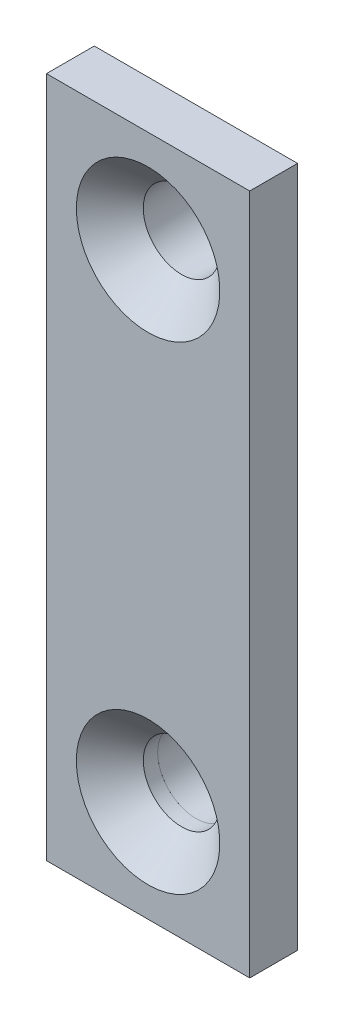
ISO-10303-21;
HEADER;
FILE_DESCRIPTION(('STEP AP214'),'2;1');
FILE_NAME('part.step','',(''),(''),'','','');
FILE_SCHEMA(('AUTOMOTIVE_DESIGN { 1 0 10303 214 1 1 1 1 }'));
ENDSEC;
DATA;
#1=APPLICATION_CONTEXT('core data for automotive mechanical design processes');
#2=APPLICATION_PROTOCOL_DEFINITION('international standard','automotive_design',2000,#1);
#3=PRODUCT_CONTEXT('',#1,'mechanical');
#4=PRODUCT('Part','Part','',(#3));
#5=PRODUCT_RELATED_PRODUCT_CATEGORY('part','',(#4));
#6=PRODUCT_DEFINITION_FORMATION('','',#4);
#7=PRODUCT_DEFINITION_CONTEXT('part definition',#1,'design');
#8=PRODUCT_DEFINITION('design','',#6,#7);
#9=PRODUCT_DEFINITION_SHAPE('','',#8);
#10=(LENGTH_UNIT() NAMED_UNIT(*) SI_UNIT(.MILLI.,.METRE.));
#11=(NAMED_UNIT(*) PLANE_ANGLE_UNIT() SI_UNIT($,.RADIAN.));
#12=(NAMED_UNIT(*) SI_UNIT($,.STERADIAN.) SOLID_ANGLE_UNIT());
#13=UNCERTAINTY_MEASURE_WITH_UNIT(LENGTH_MEASURE(1.E-05),#10,'distance_accuracy_value','');
#14=(GEOMETRIC_REPRESENTATION_CONTEXT(3) GLOBAL_UNCERTAINTY_ASSIGNED_CONTEXT((#13)) GLOBAL_UNIT_ASSIGNED_CONTEXT((#10,
#11,#12)) REPRESENTATION_CONTEXT('',''));
#15=CARTESIAN_POINT('',(0.,0.,0.));
#16=DIRECTION('',(0.,0.,1.));
#17=DIRECTION('',(1.,0.,0.));
#18=AXIS2_PLACEMENT_3D('',#15,#16,#17);
#19=CARTESIAN_POINT('',(0.,-7.5,2.));
#20=DIRECTION('',(0.,1.,0.));
#21=DIRECTION('',(0.,0.,1.));
#22=AXIS2_PLACEMENT_3D('',#19,#20,#21);
#23=PLANE('',#22);
#24=DIRECTION('',(1.,0.,0.));
#25=VECTOR('',#24,1.);
#26=CARTESIAN_POINT('',(0.,-7.5,0.));
#27=LINE('',#26,#25);
#28=CARTESIAN_POINT('',(-2.25,-7.5,0.));
#29=VERTEX_POINT('',#28);
#30=CARTESIAN_POINT('',(2.25,-7.5,0.));
#31=VERTEX_POINT('',#30);
#32=EDGE_CURVE('E171',#29,#31,#27,.T.);
#33=ORIENTED_EDGE('',*,*,#32,.F.);
#34=DIRECTION('',(0.,0.,-1.));
#35=VECTOR('',#34,1.);
#36=CARTESIAN_POINT('',(-2.25,-7.5,2.));
#37=LINE('',#36,#35);
#38=CARTESIAN_POINT('',(-2.25,-7.5,2.));
#39=VERTEX_POINT('',#38);
#40=EDGE_CURVE('E13',#39,#29,#37,.T.);
#41=ORIENTED_EDGE('',*,*,#40,.F.);
#42=DIRECTION('',(1.,0.,0.));
#43=VECTOR('',#42,1.);
#44=CARTESIAN_POINT('',(0.,-7.5,2.));
#45=LINE('',#44,#43);
#46=CARTESIAN_POINT('',(2.25,-7.5,2.));
#47=VERTEX_POINT('',#46);
#48=EDGE_CURVE('E155',#39,#47,#45,.T.);
#49=ORIENTED_EDGE('',*,*,#48,.T.);
#50=DIRECTION('',(0.,0.,-1.));
#51=VECTOR('',#50,1.);
#52=CARTESIAN_POINT('',(2.25,-7.5,2.));
#53=LINE('',#52,#51);
#54=EDGE_CURVE('E132',#47,#31,#53,.T.);
#55=ORIENTED_EDGE('',*,*,#54,.T.);
#56=EDGE_LOOP('',(#33,#41,#49,#55));
#57=FACE_BOUND('',#56,.T.);
#58=ADVANCED_FACE('F91',(#57),#23,.T.);
#59=CARTESIAN_POINT('',(-2.25,0.,2.));
#60=DIRECTION('',(-1.,0.,0.));
#61=DIRECTION('',(0.,0.,1.));
#62=AXIS2_PLACEMENT_3D('',#59,#60,#61);
#63=PLANE('',#62);
#64=DIRECTION('',(0.,1.,0.));
#65=VECTOR('',#64,1.);
#66=CARTESIAN_POINT('',(-2.25,0.,0.));
#67=LINE('',#66,#65);
#68=CARTESIAN_POINT('',(-2.25,-12.25,0.));
#69=VERTEX_POINT('',#68);
#70=EDGE_CURVE('E144',#69,#29,#67,.T.);
#71=ORIENTED_EDGE('',*,*,#70,.F.);
#72=DIRECTION('',(0.,0.,-1.));
#73=VECTOR('',#72,1.);
#74=CARTESIAN_POINT('',(-2.25,-12.25,2.));
#75=LINE('',#74,#73);
#76=CARTESIAN_POINT('',(-2.25,-12.25,2.));
#77=VERTEX_POINT('',#76);
#78=EDGE_CURVE('E101',#77,#69,#75,.T.);
#79=ORIENTED_EDGE('',*,*,#78,.F.);
#80=DIRECTION('',(0.,1.,0.));
#81=VECTOR('',#80,1.);
#82=CARTESIAN_POINT('',(-2.25,0.,2.));
#83=LINE('',#82,#81);
#84=EDGE_CURVE('E142',#77,#39,#83,.T.);
#85=ORIENTED_EDGE('',*,*,#84,.T.);
#86=ORIENTED_EDGE('',*,*,#40,.T.);
#87=EDGE_LOOP('',(#71,#79,#85,#86));
#88=FACE_BOUND('',#87,.T.);
#89=ADVANCED_FACE('F140',(#88),#63,.T.);
#90=CARTESIAN_POINT('',(0.,-12.25,2.));
#91=DIRECTION('',(0.,1.,0.));
#92=DIRECTION('',(0.,0.,1.));
#93=AXIS2_PLACEMENT_3D('',#90,#91,#92);
#94=PLANE('',#93);
#95=DIRECTION('',(1.,0.,0.));
#96=VECTOR('',#95,1.);
#97=CARTESIAN_POINT('',(0.,-12.25,0.));
#98=LINE('',#97,#96);
#99=CARTESIAN_POINT('',(2.25,-12.25,0.));
#100=VERTEX_POINT('',#99);
#101=EDGE_CURVE('E175',#69,#100,#98,.T.);
#102=ORIENTED_EDGE('',*,*,#101,.T.);
#103=DIRECTION('',(0.,0.,-1.));
#104=VECTOR('',#103,1.);
#105=CARTESIAN_POINT('',(2.25,-12.25,2.));
#106=LINE('',#105,#104);
#107=CARTESIAN_POINT('',(2.25,-12.25,2.));
#108=VERTEX_POINT('',#107);
#109=EDGE_CURVE('E148',#108,#100,#106,.T.);
#110=ORIENTED_EDGE('',*,*,#109,.F.);
#111=DIRECTION('',(1.,0.,0.));
#112=VECTOR('',#111,1.);
#113=CARTESIAN_POINT('',(0.,-12.25,2.));
#114=LINE('',#113,#112);
#115=EDGE_CURVE('E150',#77,#108,#114,.T.);
#116=ORIENTED_EDGE('',*,*,#115,.F.);
#117=ORIENTED_EDGE('',*,*,#78,.T.);
#118=EDGE_LOOP('',(#102,#110,#116,#117));
#119=FACE_BOUND('',#118,.T.);
#120=ADVANCED_FACE('F151',(#119),#94,.F.);
#121=CARTESIAN_POINT('',(0.,-10.,2.));
#122=DIRECTION('',(0.,0.,-1.));
#123=DIRECTION('',(-1.,0.,0.));
#124=AXIS2_PLACEMENT_3D('',#121,#122,#123);
#125=CYLINDRICAL_SURFACE('',#124,1.6);
#126=CARTESIAN_POINT('',(0.,-10.,2.));
#127=DIRECTION('',(0.,0.,1.));
#128=DIRECTION('',(1.,0.,0.));
#129=AXIS2_PLACEMENT_3D('',#126,#127,#128);
#130=CIRCLE('',#129,1.6);
#131=CARTESIAN_POINT('',(1.6,-10.,2.));
#132=VERTEX_POINT('',#131);
#133=EDGE_CURVE('E161',#132,#132,#130,.T.);
#134=ORIENTED_EDGE('',*,*,#133,.T.);
#135=EDGE_LOOP('',(#134));
#136=FACE_BOUND('',#135,.T.);
#137=CARTESIAN_POINT('',(0.,-10.,0.));
#138=DIRECTION('',(0.,0.,1.));
#139=DIRECTION('',(1.,0.,0.));
#140=AXIS2_PLACEMENT_3D('',#137,#138,#139);
#141=CIRCLE('',#140,1.6);
#142=CARTESIAN_POINT('',(1.6,-10.,0.));
#143=VERTEX_POINT('',#142);
#144=EDGE_CURVE('E167',#143,#143,#141,.T.);
#145=ORIENTED_EDGE('',*,*,#144,.F.);
#146=EDGE_LOOP('',(#145));
#147=FACE_BOUND('',#146,.T.);
#148=ADVANCED_FACE('F93',(#136,#147),#125,.F.);
#149=CARTESIAN_POINT('',(2.25,0.,2.));
#150=DIRECTION('',(-1.,0.,0.));
#151=DIRECTION('',(0.,0.,1.));
#152=AXIS2_PLACEMENT_3D('',#149,#150,#151);
#153=PLANE('',#152);
#154=DIRECTION('',(0.,1.,0.));
#155=VECTOR('',#154,1.);
#156=CARTESIAN_POINT('',(2.25,0.,0.));
#157=LINE('',#156,#155);
#158=EDGE_CURVE('E125',#100,#31,#157,.T.);
#159=ORIENTED_EDGE('',*,*,#158,.T.);
#160=ORIENTED_EDGE('',*,*,#54,.F.);
#161=DIRECTION('',(0.,1.,0.));
#162=VECTOR('',#161,1.);
#163=CARTESIAN_POINT('',(2.25,0.,2.));
#164=LINE('',#163,#162);
#165=EDGE_CURVE('E109',#108,#47,#164,.T.);
#166=ORIENTED_EDGE('',*,*,#165,.F.);
#167=ORIENTED_EDGE('',*,*,#109,.T.);
#168=EDGE_LOOP('',(#159,#160,#166,#167));
#169=FACE_BOUND('',#168,.T.);
#170=ADVANCED_FACE('F183',(#169),#153,.F.);
#171=CARTESIAN_POINT('',(0.,0.,2.));
#172=DIRECTION('',(0.,0.,1.));
#173=DIRECTION('',(1.,0.,0.));
#174=AXIS2_PLACEMENT_3D('',#171,#172,#173);
#175=PLANE('',#174);
#176=ORIENTED_EDGE('',*,*,#133,.F.);
#177=EDGE_LOOP('',(#176));
#178=FACE_BOUND('',#177,.T.);
#179=ORIENTED_EDGE('',*,*,#48,.F.);
#180=ORIENTED_EDGE('',*,*,#84,.F.);
#181=ORIENTED_EDGE('',*,*,#115,.T.);
#182=ORIENTED_EDGE('',*,*,#165,.T.);
#183=EDGE_LOOP('',(#179,#180,#181,#182));
#184=FACE_BOUND('',#183,.T.);
#185=ADVANCED_FACE('F154',(#178,#184),#175,.T.);
#186=CARTESIAN_POINT('',(0.,0.,0.));
#187=DIRECTION('',(0.,0.,1.));
#188=DIRECTION('',(1.,0.,0.));
#189=AXIS2_PLACEMENT_3D('',#186,#187,#188);
#190=PLANE('',#189);
#191=ORIENTED_EDGE('',*,*,#144,.T.);
#192=EDGE_LOOP('',(#191));
#193=FACE_BOUND('',#192,.T.);
#194=ORIENTED_EDGE('',*,*,#32,.T.);
#195=ORIENTED_EDGE('',*,*,#158,.F.);
#196=ORIENTED_EDGE('',*,*,#101,.F.);
#197=ORIENTED_EDGE('',*,*,#70,.T.);
#198=EDGE_LOOP('',(#194,#195,#196,#197));
#199=FACE_BOUND('',#198,.T.);
#200=ADVANCED_FACE('F184',(#193,#199),#190,.F.);
#201=CLOSED_SHELL('',(#58,#89,#120,#148,#170,#185,#200));
#202=MANIFOLD_SOLID_BREP('B2',#201);
#203=CARTESIAN_POINT('',(-2.25,0.,2.));
#204=DIRECTION('',(-1.,0.,0.));
#205=DIRECTION('',(0.,0.,1.));
#206=AXIS2_PLACEMENT_3D('',#203,#204,#205);
#207=PLANE('',#206);
#208=DIRECTION('',(0.,1.,0.));
#209=VECTOR('',#208,1.);
#210=CARTESIAN_POINT('',(-2.25,0.,0.));
#211=LINE('',#210,#209);
#212=CARTESIAN_POINT('',(-2.25,7.5,0.));
#213=VERTEX_POINT('',#212);
#214=CARTESIAN_POINT('',(-2.25,12.25,0.));
#215=VERTEX_POINT('',#214);
#216=EDGE_CURVE('E317',#213,#215,#211,.T.);
#217=ORIENTED_EDGE('',*,*,#216,.F.);
#218=DIRECTION('',(0.,0.,-1.));
#219=VECTOR('',#218,1.);
#220=CARTESIAN_POINT('',(-2.25,7.5,2.));
#221=LINE('',#220,#219);
#222=CARTESIAN_POINT('',(-2.25,7.5,2.));
#223=VERTEX_POINT('',#222);
#224=EDGE_CURVE('E333',#223,#213,#221,.T.);
#225=ORIENTED_EDGE('',*,*,#224,.F.);
#226=DIRECTION('',(0.,1.,0.));
#227=VECTOR('',#226,1.);
#228=CARTESIAN_POINT('',(-2.25,0.,2.));
#229=LINE('',#228,#227);
#230=CARTESIAN_POINT('',(-2.25,12.25,2.));
#231=VERTEX_POINT('',#230);
#232=EDGE_CURVE('E319',#223,#231,#229,.T.);
#233=ORIENTED_EDGE('',*,*,#232,.T.);
#234=DIRECTION('',(0.,0.,-1.));
#235=VECTOR('',#234,1.);
#236=CARTESIAN_POINT('',(-2.25,12.25,2.));
#237=LINE('',#236,#235);
#238=EDGE_CURVE('E302',#231,#215,#237,.T.);
#239=ORIENTED_EDGE('',*,*,#238,.T.);
#240=EDGE_LOOP('',(#217,#225,#233,#239));
#241=FACE_BOUND('',#240,.T.);
#242=ADVANCED_FACE('F257',(#241),#207,.T.);
#243=CARTESIAN_POINT('',(0.,7.5,2.));
#244=DIRECTION('',(0.,1.,0.));
#245=DIRECTION('',(0.,0.,1.));
#246=AXIS2_PLACEMENT_3D('',#243,#244,#245);
#247=PLANE('',#246);
#248=DIRECTION('',(1.,0.,0.));
#249=VECTOR('',#248,1.);
#250=CARTESIAN_POINT('',(0.,7.5,0.));
#251=LINE('',#250,#249);
#252=CARTESIAN_POINT('',(2.25,7.5,0.));
#253=VERTEX_POINT('',#252);
#254=EDGE_CURVE('E312',#213,#253,#251,.T.);
#255=ORIENTED_EDGE('',*,*,#254,.T.);
#256=DIRECTION('',(0.,0.,-1.));
#257=VECTOR('',#256,1.);
#258=CARTESIAN_POINT('',(2.25,7.5,2.));
#259=LINE('',#258,#257);
#260=CARTESIAN_POINT('',(2.25,7.5,2.));
#261=VERTEX_POINT('',#260);
#262=EDGE_CURVE('E301',#261,#253,#259,.T.);
#263=ORIENTED_EDGE('',*,*,#262,.F.);
#264=DIRECTION('',(1.,0.,0.));
#265=VECTOR('',#264,1.);
#266=CARTESIAN_POINT('',(0.,7.5,2.));
#267=LINE('',#266,#265);
#268=EDGE_CURVE('E325',#223,#261,#267,.T.);
#269=ORIENTED_EDGE('',*,*,#268,.F.);
#270=ORIENTED_EDGE('',*,*,#224,.T.);
#271=EDGE_LOOP('',(#255,#263,#269,#270));
#272=FACE_BOUND('',#271,.T.);
#273=ADVANCED_FACE('F380',(#272),#247,.F.);
#274=CARTESIAN_POINT('',(2.25,0.,2.));
#275=DIRECTION('',(-1.,0.,0.));
#276=DIRECTION('',(0.,0.,1.));
#277=AXIS2_PLACEMENT_3D('',#274,#275,#276);
#278=PLANE('',#277);
#279=DIRECTION('',(0.,1.,0.));
#280=VECTOR('',#279,1.);
#281=CARTESIAN_POINT('',(2.25,0.,0.));
#282=LINE('',#281,#280);
#283=CARTESIAN_POINT('',(2.25,12.25,0.));
#284=VERTEX_POINT('',#283);
#285=EDGE_CURVE('E305',#253,#284,#282,.T.);
#286=ORIENTED_EDGE('',*,*,#285,.T.);
#287=DIRECTION('',(0.,0.,-1.));
#288=VECTOR('',#287,1.);
#289=CARTESIAN_POINT('',(2.25,12.25,2.));
#290=LINE('',#289,#288);
#291=CARTESIAN_POINT('',(2.25,12.25,2.));
#292=VERTEX_POINT('',#291);
#293=EDGE_CURVE('E292',#292,#284,#290,.T.);
#294=ORIENTED_EDGE('',*,*,#293,.F.);
#295=DIRECTION('',(0.,1.,0.));
#296=VECTOR('',#295,1.);
#297=CARTESIAN_POINT('',(2.25,0.,2.));
#298=LINE('',#297,#296);
#299=EDGE_CURVE('E275',#261,#292,#298,.T.);
#300=ORIENTED_EDGE('',*,*,#299,.F.);
#301=ORIENTED_EDGE('',*,*,#262,.T.);
#302=EDGE_LOOP('',(#286,#294,#300,#301));
#303=FACE_BOUND('',#302,.T.);
#304=ADVANCED_FACE('F306',(#303),#278,.F.);
#305=CARTESIAN_POINT('',(0.,10.,2.));
#306=DIRECTION('',(0.,0.,-1.));
#307=DIRECTION('',(-1.,0.,0.));
#308=AXIS2_PLACEMENT_3D('',#305,#306,#307);
#309=CYLINDRICAL_SURFACE('',#308,1.6);
#310=CARTESIAN_POINT('',(0.,10.,2.6));
#311=DIRECTION('',(0.,0.,-1.));
#312=DIRECTION('',(-1.,0.,0.));
#313=AXIS2_PLACEMENT_3D('',#310,#311,#312);
#314=CIRCLE('',#313,1.6);
#315=CARTESIAN_POINT('',(-1.6,10.,2.6));
#316=VERTEX_POINT('',#315);
#317=EDGE_CURVE('E336',#316,#316,#314,.F.);
#318=ORIENTED_EDGE('',*,*,#317,.T.);
#319=EDGE_LOOP('',(#318));
#320=FACE_BOUND('',#319,.T.);
#321=CARTESIAN_POINT('',(0.,10.,0.));
#322=DIRECTION('',(0.,0.,1.));
#323=DIRECTION('',(1.,0.,0.));
#324=AXIS2_PLACEMENT_3D('',#321,#322,#323);
#325=CIRCLE('',#324,1.6);
#326=CARTESIAN_POINT('',(1.6,10.,0.));
#327=VERTEX_POINT('',#326);
#328=EDGE_CURVE('E363',#327,#327,#325,.T.);
#329=ORIENTED_EDGE('',*,*,#328,.F.);
#330=EDGE_LOOP('',(#329));
#331=FACE_BOUND('',#330,.T.);
#332=ADVANCED_FACE('F357',(#320,#331),#309,.F.);
#333=CARTESIAN_POINT('',(0.,12.25,2.));
#334=DIRECTION('',(0.,1.,0.));
#335=DIRECTION('',(0.,0.,1.));
#336=AXIS2_PLACEMENT_3D('',#333,#334,#335);
#337=PLANE('',#336);
#338=DIRECTION('',(1.,0.,0.));
#339=VECTOR('',#338,1.);
#340=CARTESIAN_POINT('',(0.,12.25,0.));
#341=LINE('',#340,#339);
#342=EDGE_CURVE('E297',#215,#284,#341,.T.);
#343=ORIENTED_EDGE('',*,*,#342,.F.);
#344=ORIENTED_EDGE('',*,*,#238,.F.);
#345=DIRECTION('',(1.,0.,0.));
#346=VECTOR('',#345,1.);
#347=CARTESIAN_POINT('',(0.,12.25,2.));
#348=LINE('',#347,#346);
#349=EDGE_CURVE('E298',#231,#292,#348,.T.);
#350=ORIENTED_EDGE('',*,*,#349,.T.);
#351=ORIENTED_EDGE('',*,*,#293,.T.);
#352=EDGE_LOOP('',(#343,#344,#350,#351));
#353=FACE_BOUND('',#352,.T.);
#354=ADVANCED_FACE('F294',(#353),#337,.T.);
#355=CARTESIAN_POINT('',(0.,0.,0.));
#356=DIRECTION('',(0.,0.,1.));
#357=DIRECTION('',(1.,0.,0.));
#358=AXIS2_PLACEMENT_3D('',#355,#356,#357);
#359=PLANE('',#358);
#360=ORIENTED_EDGE('',*,*,#328,.T.);
#361=EDGE_LOOP('',(#360));
#362=FACE_BOUND('',#361,.T.);
#363=ORIENTED_EDGE('',*,*,#216,.T.);
#364=ORIENTED_EDGE('',*,*,#342,.T.);
#365=ORIENTED_EDGE('',*,*,#285,.F.);
#366=ORIENTED_EDGE('',*,*,#254,.F.);
#367=EDGE_LOOP('',(#363,#364,#365,#366));
#368=FACE_BOUND('',#367,.T.);
#369=ADVANCED_FACE('F315',(#362,#368),#359,.F.);
#370=CARTESIAN_POINT('',(0.,0.,2.));
#371=DIRECTION('',(0.,0.,-1.));
#372=DIRECTION('',(-1.,0.,0.));
#373=AXIS2_PLACEMENT_3D('',#370,#371,#372);
#374=PLANE('',#373);
#375=DIRECTION('',(0.,-1.,0.));
#376=VECTOR('',#375,1.);
#377=CARTESIAN_POINT('',(4.25,0.,2.));
#378=LINE('',#377,#376);
#379=CARTESIAN_POINT('',(4.25,14.25,2.));
#380=VERTEX_POINT('',#379);
#381=CARTESIAN_POINT('',(4.25,-14.25,2.));
#382=VERTEX_POINT('',#381);
#383=EDGE_CURVE('E449',#380,#382,#378,.T.);
#384=ORIENTED_EDGE('',*,*,#383,.T.);
#385=DIRECTION('',(-1.,0.,0.));
#386=VECTOR('',#385,1.);
#387=CARTESIAN_POINT('',(0.,-14.25,2.));
#388=LINE('',#387,#386);
#389=CARTESIAN_POINT('',(-4.25,-14.25,2.));
#390=VERTEX_POINT('',#389);
#391=EDGE_CURVE('E419',#382,#390,#388,.T.);
#392=ORIENTED_EDGE('',*,*,#391,.T.);
#393=DIRECTION('',(0.,-1.,0.));
#394=VECTOR('',#393,1.);
#395=CARTESIAN_POINT('',(-4.25,0.,2.));
#396=LINE('',#395,#394);
#397=CARTESIAN_POINT('',(-4.25,14.25,2.));
#398=VERTEX_POINT('',#397);
#399=EDGE_CURVE('E441',#398,#390,#396,.T.);
#400=ORIENTED_EDGE('',*,*,#399,.F.);
#401=DIRECTION('',(-1.,0.,0.));
#402=VECTOR('',#401,1.);
#403=CARTESIAN_POINT('',(0.,14.25,2.));
#404=LINE('',#403,#402);
#405=EDGE_CURVE('E438',#380,#398,#404,.T.);
#406=ORIENTED_EDGE('',*,*,#405,.F.);
#407=EDGE_LOOP('',(#384,#392,#400,#406));
#408=FACE_BOUND('',#407,.T.);
#409=CARTESIAN_POINT('',(0.,-10.,2.));
#410=DIRECTION('',(0.,0.,1.));
#411=DIRECTION('',(1.,0.,0.));
#412=AXIS2_PLACEMENT_3D('',#409,#410,#411);
#413=CIRCLE('',#412,1.6);
#414=CARTESIAN_POINT('',(1.6,-10.,2.));
#415=VERTEX_POINT('',#414);
#416=EDGE_CURVE('E444',#415,#415,#413,.T.);
#417=ORIENTED_EDGE('',*,*,#416,.T.);
#418=EDGE_LOOP('',(#417));
#419=FACE_BOUND('',#418,.T.);
#420=ORIENTED_EDGE('',*,*,#232,.F.);
#421=ORIENTED_EDGE('',*,*,#268,.T.);
#422=ORIENTED_EDGE('',*,*,#299,.T.);
#423=ORIENTED_EDGE('',*,*,#349,.F.);
#424=EDGE_LOOP('',(#420,#421,#422,#423));
#425=FACE_BOUND('',#424,.T.);
#426=ADVANCED_FACE('F466',(#408,#419,#425),#374,.T.);
#427=CARTESIAN_POINT('',(0.,0.,4.));
#428=DIRECTION('',(0.,0.,-1.));
#429=DIRECTION('',(-1.,0.,0.));
#430=AXIS2_PLACEMENT_3D('',#427,#428,#429);
#431=PLANE('',#430);
#432=CARTESIAN_POINT('',(0.,10.,4.));
#433=DIRECTION('',(0.,0.,-1.));
#434=DIRECTION('',(-1.,0.,0.));
#435=AXIS2_PLACEMENT_3D('',#432,#433,#434);
#436=CIRCLE('',#435,3.00000000000001);
#437=CARTESIAN_POINT('',(-3.00000000000001,10.,4.));
#438=VERTEX_POINT('',#437);
#439=EDGE_CURVE('E268',#438,#438,#436,.T.);
#440=ORIENTED_EDGE('',*,*,#439,.T.);
#441=EDGE_LOOP('',(#440));
#442=FACE_BOUND('',#441,.T.);
#443=CARTESIAN_POINT('',(0.,-10.,4.));
#444=DIRECTION('',(0.,0.,-1.));
#445=DIRECTION('',(-1.,0.,0.));
#446=AXIS2_PLACEMENT_3D('',#443,#444,#445);
#447=CIRCLE('',#446,3.00000000000001);
#448=CARTESIAN_POINT('',(-3.00000000000001,-10.,4.));
#449=VERTEX_POINT('',#448);
#450=EDGE_CURVE('E340',#449,#449,#447,.T.);
#451=ORIENTED_EDGE('',*,*,#450,.T.);
#452=EDGE_LOOP('',(#451));
#453=FACE_BOUND('',#452,.T.);
#454=DIRECTION('',(0.,-1.,0.));
#455=VECTOR('',#454,1.);
#456=CARTESIAN_POINT('',(4.25,0.,4.));
#457=LINE('',#456,#455);
#458=CARTESIAN_POINT('',(4.25,14.25,4.));
#459=VERTEX_POINT('',#458);
#460=CARTESIAN_POINT('',(4.25,-14.25,4.));
#461=VERTEX_POINT('',#460);
#462=EDGE_CURVE('E430',#459,#461,#457,.T.);
#463=ORIENTED_EDGE('',*,*,#462,.F.);
#464=DIRECTION('',(-1.,0.,0.));
#465=VECTOR('',#464,1.);
#466=CARTESIAN_POINT('',(0.,14.25,4.));
#467=LINE('',#466,#465);
#468=CARTESIAN_POINT('',(-4.25,14.25,4.));
#469=VERTEX_POINT('',#468);
#470=EDGE_CURVE('E426',#459,#469,#467,.T.);
#471=ORIENTED_EDGE('',*,*,#470,.T.);
#472=DIRECTION('',(0.,-1.,0.));
#473=VECTOR('',#472,1.);
#474=CARTESIAN_POINT('',(-4.25,0.,4.));
#475=LINE('',#474,#473);
#476=CARTESIAN_POINT('',(-4.25,-14.25,4.));
#477=VERTEX_POINT('',#476);
#478=EDGE_CURVE('E432',#469,#477,#475,.T.);
#479=ORIENTED_EDGE('',*,*,#478,.T.);
#480=DIRECTION('',(-1.,0.,0.));
#481=VECTOR('',#480,1.);
#482=CARTESIAN_POINT('',(0.,-14.25,4.));
#483=LINE('',#482,#481);
#484=EDGE_CURVE('E417',#461,#477,#483,.T.);
#485=ORIENTED_EDGE('',*,*,#484,.F.);
#486=EDGE_LOOP('',(#463,#471,#479,#485));
#487=FACE_BOUND('',#486,.T.);
#488=ADVANCED_FACE('F348',(#442,#453,#487),#431,.F.);
#489=CARTESIAN_POINT('',(4.25,0.,4.));
#490=DIRECTION('',(1.,0.,0.));
#491=DIRECTION('',(0.,0.,-1.));
#492=AXIS2_PLACEMENT_3D('',#489,#490,#491);
#493=PLANE('',#492);
#494=ORIENTED_EDGE('',*,*,#383,.F.);
#495=DIRECTION('',(0.,0.,-1.));
#496=VECTOR('',#495,1.);
#497=CARTESIAN_POINT('',(4.25,14.25,4.));
#498=LINE('',#497,#496);
#499=EDGE_CURVE('E366',#459,#380,#498,.T.);
#500=ORIENTED_EDGE('',*,*,#499,.F.);
#501=ORIENTED_EDGE('',*,*,#462,.T.);
#502=DIRECTION('',(0.,0.,-1.));
#503=VECTOR('',#502,1.);
#504=CARTESIAN_POINT('',(4.25,-14.25,4.));
#505=LINE('',#504,#503);
#506=EDGE_CURVE('E414',#461,#382,#505,.T.);
#507=ORIENTED_EDGE('',*,*,#506,.T.);
#508=EDGE_LOOP('',(#494,#500,#501,#507));
#509=FACE_BOUND('',#508,.T.);
#510=ADVANCED_FACE('F435',(#509),#493,.T.);
#511=CARTESIAN_POINT('',(0.,14.25,4.));
#512=DIRECTION('',(0.,-1.,0.));
#513=DIRECTION('',(1.,0.,0.));
#514=AXIS2_PLACEMENT_3D('',#511,#512,#513);
#515=PLANE('',#514);
#516=ORIENTED_EDGE('',*,*,#405,.T.);
#517=DIRECTION('',(0.,0.,-1.));
#518=VECTOR('',#517,1.);
#519=CARTESIAN_POINT('',(-4.25,14.25,4.));
#520=LINE('',#519,#518);
#521=EDGE_CURVE('E374',#469,#398,#520,.T.);
#522=ORIENTED_EDGE('',*,*,#521,.F.);
#523=ORIENTED_EDGE('',*,*,#470,.F.);
#524=ORIENTED_EDGE('',*,*,#499,.T.);
#525=EDGE_LOOP('',(#516,#522,#523,#524));
#526=FACE_BOUND('',#525,.T.);
#527=ADVANCED_FACE('F494',(#526),#515,.F.);
#528=CARTESIAN_POINT('',(-4.25,0.,4.));
#529=DIRECTION('',(1.,0.,0.));
#530=DIRECTION('',(0.,0.,-1.));
#531=AXIS2_PLACEMENT_3D('',#528,#529,#530);
#532=PLANE('',#531);
#533=ORIENTED_EDGE('',*,*,#399,.T.);
#534=DIRECTION('',(0.,0.,-1.));
#535=VECTOR('',#534,1.);
#536=CARTESIAN_POINT('',(-4.25,-14.25,4.));
#537=LINE('',#536,#535);
#538=EDGE_CURVE('E425',#477,#390,#537,.T.);
#539=ORIENTED_EDGE('',*,*,#538,.F.);
#540=ORIENTED_EDGE('',*,*,#478,.F.);
#541=ORIENTED_EDGE('',*,*,#521,.T.);
#542=EDGE_LOOP('',(#533,#539,#540,#541));
#543=FACE_BOUND('',#542,.T.);
#544=ADVANCED_FACE('F473',(#543),#532,.F.);
#545=CARTESIAN_POINT('',(0.,-14.25,4.));
#546=DIRECTION('',(0.,-1.,0.));
#547=DIRECTION('',(1.,0.,0.));
#548=AXIS2_PLACEMENT_3D('',#545,#546,#547);
#549=PLANE('',#548);
#550=ORIENTED_EDGE('',*,*,#391,.F.);
#551=ORIENTED_EDGE('',*,*,#506,.F.);
#552=ORIENTED_EDGE('',*,*,#484,.T.);
#553=ORIENTED_EDGE('',*,*,#538,.T.);
#554=EDGE_LOOP('',(#550,#551,#552,#553));
#555=FACE_BOUND('',#554,.T.);
#556=ADVANCED_FACE('F416',(#555),#549,.T.);
#557=CARTESIAN_POINT('',(0.,-10.,4.));
#558=DIRECTION('',(0.,0.,-1.));
#559=DIRECTION('',(-1.,0.,0.));
#560=AXIS2_PLACEMENT_3D('',#557,#558,#559);
#561=CYLINDRICAL_SURFACE('',#560,1.6);
#562=CARTESIAN_POINT('',(0.,-10.,2.6));
#563=DIRECTION('',(0.,0.,-1.));
#564=DIRECTION('',(-1.,0.,0.));
#565=AXIS2_PLACEMENT_3D('',#562,#563,#564);
#566=CIRCLE('',#565,1.6);
#567=CARTESIAN_POINT('',(-1.6,-10.,2.6));
#568=VERTEX_POINT('',#567);
#569=EDGE_CURVE('E89',#568,#568,#566,.F.);
#570=ORIENTED_EDGE('',*,*,#569,.T.);
#571=EDGE_LOOP('',(#570));
#572=FACE_BOUND('',#571,.T.);
#573=ORIENTED_EDGE('',*,*,#416,.F.);
#574=EDGE_LOOP('',(#573));
#575=FACE_BOUND('',#574,.T.);
#576=ADVANCED_FACE('F354',(#572,#575),#561,.F.);
#577=CARTESIAN_POINT('',(0.,10.,2.6));
#578=DIRECTION('',(0.,0.,1.));
#579=DIRECTION('',(1.,0.,0.));
#580=AXIS2_PLACEMENT_3D('',#577,#578,#579);
#581=CONICAL_SURFACE('',#580,1.6,0.785398163397451);
#582=ORIENTED_EDGE('',*,*,#439,.F.);
#583=EDGE_LOOP('',(#582));
#584=FACE_BOUND('',#583,.T.);
#585=ORIENTED_EDGE('',*,*,#317,.F.);
#586=EDGE_LOOP('',(#585));
#587=FACE_BOUND('',#586,.T.);
#588=ADVANCED_FACE('F351',(#584,#587),#581,.F.);
#589=CARTESIAN_POINT('',(0.,-10.,2.6));
#590=DIRECTION('',(0.,0.,1.));
#591=DIRECTION('',(1.,0.,0.));
#592=AXIS2_PLACEMENT_3D('',#589,#590,#591);
#593=CONICAL_SURFACE('',#592,1.6,0.785398163397451);
#594=ORIENTED_EDGE('',*,*,#450,.F.);
#595=EDGE_LOOP('',(#594));
#596=FACE_BOUND('',#595,.T.);
#597=ORIENTED_EDGE('',*,*,#569,.F.);
#598=EDGE_LOOP('',(#597));
#599=FACE_BOUND('',#598,.T.);
#600=ADVANCED_FACE('F260',(#596,#599),#593,.F.);
#601=CLOSED_SHELL('',(#242,#273,#304,#332,#354,#369,#426,#488,#510,#527,#544,#556,#576,#588,#600));
#602=MANIFOLD_SOLID_BREP('B7',#601);
#603=ADVANCED_BREP_SHAPE_REPRESENTATION('',(#18,#202,#602),#14);
#604=SHAPE_DEFINITION_REPRESENTATION(#9,#603);
ENDSEC;
END-ISO-10303-21;
